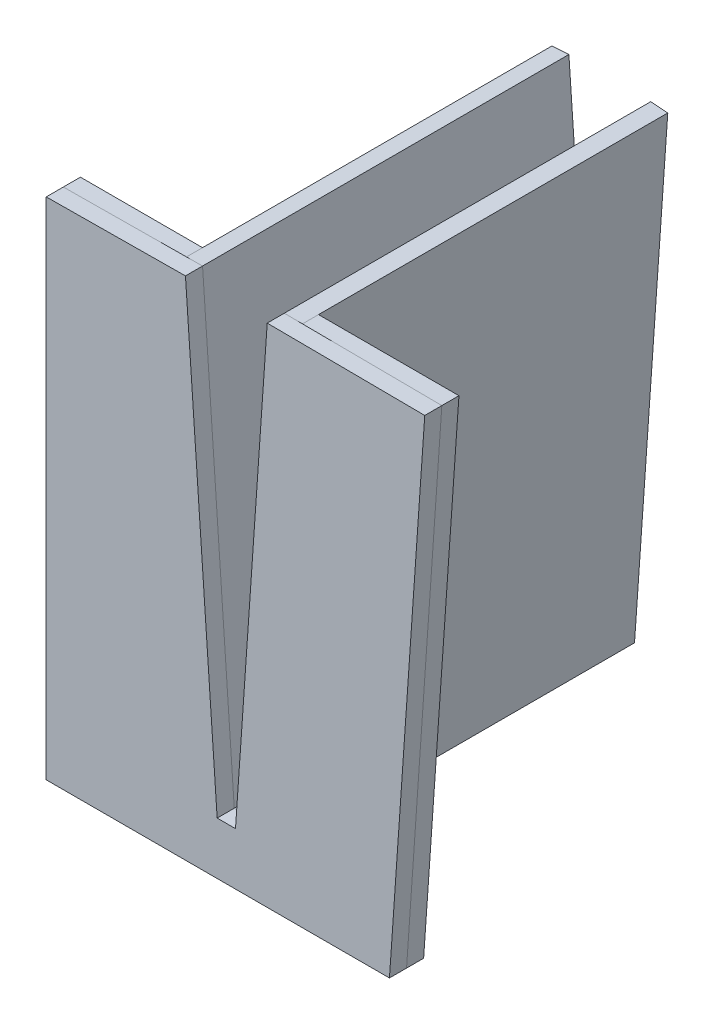
ISO-10303-21;
HEADER;
FILE_DESCRIPTION(('STEP AP214'),'2;1');
FILE_NAME('part.step','',(''),(''),'','','');
FILE_SCHEMA(('AUTOMOTIVE_DESIGN { 1 0 10303 214 1 1 1 1 }'));
ENDSEC;
DATA;
#1=APPLICATION_CONTEXT('core data for automotive mechanical design processes');
#2=APPLICATION_PROTOCOL_DEFINITION('international standard','automotive_design',2000,#1);
#3=PRODUCT_CONTEXT('',#1,'mechanical');
#4=PRODUCT('Part','Part','',(#3));
#5=PRODUCT_RELATED_PRODUCT_CATEGORY('part','',(#4));
#6=PRODUCT_DEFINITION_FORMATION('','',#4);
#7=PRODUCT_DEFINITION_CONTEXT('part definition',#1,'design');
#8=PRODUCT_DEFINITION('design','',#6,#7);
#9=PRODUCT_DEFINITION_SHAPE('','',#8);
#10=(LENGTH_UNIT() NAMED_UNIT(*) SI_UNIT(.MILLI.,.METRE.));
#11=(NAMED_UNIT(*) PLANE_ANGLE_UNIT() SI_UNIT($,.RADIAN.));
#12=(NAMED_UNIT(*) SI_UNIT($,.STERADIAN.) SOLID_ANGLE_UNIT());
#13=UNCERTAINTY_MEASURE_WITH_UNIT(LENGTH_MEASURE(1.E-05),#10,'distance_accuracy_value','');
#14=(GEOMETRIC_REPRESENTATION_CONTEXT(3) GLOBAL_UNCERTAINTY_ASSIGNED_CONTEXT((#13)) GLOBAL_UNIT_ASSIGNED_CONTEXT((#10,
#11,#12)) REPRESENTATION_CONTEXT('',''));
#15=CARTESIAN_POINT('',(0.,0.,0.));
#16=DIRECTION('',(0.,0.,1.));
#17=DIRECTION('',(1.,0.,0.));
#18=AXIS2_PLACEMENT_3D('',#15,#16,#17);
#19=CARTESIAN_POINT('',(-6.69560871661063,77.8758328208899,32.8));
#20=DIRECTION('',(-0.997564050259824,-0.0697564737441254,0.));
#21=DIRECTION('',(0.0697564737441255,-0.997564050259824,0.));
#22=AXIS2_PLACEMENT_3D('',#19,#20,#21);
#23=PLANE('',#22);
#24=DIRECTION('',(-0.0697564737441255,0.997564050259824,0.));
#25=VECTOR('',#24,1.);
#26=CARTESIAN_POINT('',(-6.69560871661063,77.8758328208899,30.));
#27=LINE('',#26,#25);
#28=CARTESIAN_POINT('',(-1.5,3.57516656417799,30.));
#29=VERTEX_POINT('',#28);
#30=CARTESIAN_POINT('',(-6.69560871661063,77.8758328208899,30.));
#31=VERTEX_POINT('',#30);
#32=EDGE_CURVE('E146',#29,#31,#27,.T.);
#33=ORIENTED_EDGE('',*,*,#32,.T.);
#34=DIRECTION('',(0.,0.,-1.));
#35=VECTOR('',#34,1.);
#36=CARTESIAN_POINT('',(-6.69560871661063,77.8758328208899,32.8));
#37=LINE('',#36,#35);
#38=CARTESIAN_POINT('',(-6.69560871661063,77.8758328208899,32.8));
#39=VERTEX_POINT('',#38);
#40=EDGE_CURVE('E12',#39,#31,#37,.T.);
#41=ORIENTED_EDGE('',*,*,#40,.F.);
#42=DIRECTION('',(-0.0697564737441255,0.997564050259824,0.));
#43=VECTOR('',#42,1.);
#44=CARTESIAN_POINT('',(-6.69560871661063,77.8758328208899,32.8));
#45=LINE('',#44,#43);
#46=CARTESIAN_POINT('',(-1.5,3.57516656417799,32.8));
#47=VERTEX_POINT('',#46);
#48=EDGE_CURVE('E160',#47,#39,#45,.T.);
#49=ORIENTED_EDGE('',*,*,#48,.F.);
#50=DIRECTION('',(0.,0.,-1.));
#51=VECTOR('',#50,1.);
#52=CARTESIAN_POINT('',(-1.5,3.57516656417799,32.8));
#53=LINE('',#52,#51);
#54=EDGE_CURVE('E142',#47,#29,#53,.T.);
#55=ORIENTED_EDGE('',*,*,#54,.T.);
#56=EDGE_LOOP('',(#33,#41,#49,#55));
#57=FACE_BOUND('',#56,.T.);
#58=ADVANCED_FACE('F50',(#57),#23,.F.);
#59=CARTESIAN_POINT('',(-6.69560871661063,77.8758328208899,32.8));
#60=DIRECTION('',(0.00858718659502427,-0.999963129433472,0.));
#61=DIRECTION('',(0.999963129433472,0.00858718659502427,0.));
#62=AXIS2_PLACEMENT_3D('',#59,#60,#61);
#63=PLANE('',#62);
#64=DIRECTION('',(-0.999963129433472,-0.00858718659502427,0.));
#65=VECTOR('',#64,1.);
#66=CARTESIAN_POINT('',(-6.69560871661063,77.8758328208899,30.));
#67=LINE('',#66,#65);
#68=CARTESIAN_POINT('',(-29.4956087166106,77.680037747448,30.));
#69=VERTEX_POINT('',#68);
#70=EDGE_CURVE('E149',#31,#69,#67,.T.);
#71=ORIENTED_EDGE('',*,*,#70,.T.);
#72=DIRECTION('',(0.,0.,-1.));
#73=VECTOR('',#72,1.);
#74=CARTESIAN_POINT('',(-29.4956087166106,77.680037747448,32.8));
#75=LINE('',#74,#73);
#76=CARTESIAN_POINT('',(-29.4956087166106,77.680037747448,32.8));
#77=VERTEX_POINT('',#76);
#78=EDGE_CURVE('E58',#77,#69,#75,.T.);
#79=ORIENTED_EDGE('',*,*,#78,.F.);
#80=DIRECTION('',(-0.999963129433472,-0.00858718659502427,0.));
#81=VECTOR('',#80,1.);
#82=CARTESIAN_POINT('',(-6.69560871661063,77.8758328208899,32.8));
#83=LINE('',#82,#81);
#84=EDGE_CURVE('E109',#39,#77,#83,.T.);
#85=ORIENTED_EDGE('',*,*,#84,.F.);
#86=ORIENTED_EDGE('',*,*,#40,.T.);
#87=EDGE_LOOP('',(#71,#79,#85,#86));
#88=FACE_BOUND('',#87,.T.);
#89=ADVANCED_FACE('F195',(#88),#63,.F.);
#90=CARTESIAN_POINT('',(-29.4956087166106,77.680037747448,32.8));
#91=DIRECTION('',(1.,0.,0.));
#92=DIRECTION('',(0.,1.,0.));
#93=AXIS2_PLACEMENT_3D('',#90,#91,#92);
#94=PLANE('',#93);
#95=DIRECTION('',(0.,-1.,0.));
#96=VECTOR('',#95,1.);
#97=CARTESIAN_POINT('',(-29.4956087166106,77.680037747448,30.));
#98=LINE('',#97,#96);
#99=CARTESIAN_POINT('',(-29.4956087166106,-5.,30.));
#100=VERTEX_POINT('',#99);
#101=EDGE_CURVE('E151',#69,#100,#98,.T.);
#102=ORIENTED_EDGE('',*,*,#101,.T.);
#103=DIRECTION('',(0.,0.,-1.));
#104=VECTOR('',#103,1.);
#105=CARTESIAN_POINT('',(-29.4956087166106,-5.,32.8));
#106=LINE('',#105,#104);
#107=CARTESIAN_POINT('',(-29.4956087166106,-5.,32.8));
#108=VERTEX_POINT('',#107);
#109=EDGE_CURVE('E167',#108,#100,#106,.T.);
#110=ORIENTED_EDGE('',*,*,#109,.F.);
#111=DIRECTION('',(0.,-1.,0.));
#112=VECTOR('',#111,1.);
#113=CARTESIAN_POINT('',(-29.4956087166106,77.680037747448,32.8));
#114=LINE('',#113,#112);
#115=EDGE_CURVE('E175',#77,#108,#114,.T.);
#116=ORIENTED_EDGE('',*,*,#115,.F.);
#117=ORIENTED_EDGE('',*,*,#78,.T.);
#118=EDGE_LOOP('',(#102,#110,#116,#117));
#119=FACE_BOUND('',#118,.T.);
#120=ADVANCED_FACE('F173',(#119),#94,.F.);
#121=CARTESIAN_POINT('',(-29.4956087166106,-5.,32.8));
#122=DIRECTION('',(0.,1.,0.));
#123=DIRECTION('',(-1.,0.,0.));
#124=AXIS2_PLACEMENT_3D('',#121,#122,#123);
#125=PLANE('',#124);
#126=DIRECTION('',(1.,0.,0.));
#127=VECTOR('',#126,1.);
#128=CARTESIAN_POINT('',(-29.4956087166106,-5.,30.));
#129=LINE('',#128,#127);
#130=CARTESIAN_POINT('',(26.7140572655625,-5.,30.));
#131=VERTEX_POINT('',#130);
#132=EDGE_CURVE('E153',#100,#131,#129,.T.);
#133=ORIENTED_EDGE('',*,*,#132,.T.);
#134=DIRECTION('',(0.,0.,-1.));
#135=VECTOR('',#134,1.);
#136=CARTESIAN_POINT('',(26.7140572655625,-5.,32.8));
#137=LINE('',#136,#135);
#138=CARTESIAN_POINT('',(26.7140572655625,-5.,32.8));
#139=VERTEX_POINT('',#138);
#140=EDGE_CURVE('E164',#139,#131,#137,.T.);
#141=ORIENTED_EDGE('',*,*,#140,.F.);
#142=DIRECTION('',(1.,0.,0.));
#143=VECTOR('',#142,1.);
#144=CARTESIAN_POINT('',(-29.4956087166106,-5.,32.8));
#145=LINE('',#144,#143);
#146=EDGE_CURVE('E187',#108,#139,#145,.T.);
#147=ORIENTED_EDGE('',*,*,#146,.F.);
#148=ORIENTED_EDGE('',*,*,#109,.T.);
#149=EDGE_LOOP('',(#133,#141,#147,#148));
#150=FACE_BOUND('',#149,.T.);
#151=ADVANCED_FACE('F183',(#150),#125,.F.);
#152=CARTESIAN_POINT('',(26.7140572655625,-5.,32.8));
#153=DIRECTION('',(-0.997564050259824,0.0697564737441254,0.));
#154=DIRECTION('',(-0.0697564737441255,-0.997564050259824,0.));
#155=AXIS2_PLACEMENT_3D('',#152,#153,#154);
#156=PLANE('',#155);
#157=DIRECTION('',(0.0697564737441254,0.997564050259824,0.));
#158=VECTOR('',#157,1.);
#159=CARTESIAN_POINT('',(26.7140572655625,-5.,30.));
#160=LINE('',#159,#158);
#161=CARTESIAN_POINT('',(32.4956087166106,77.680037747448,30.));
#162=VERTEX_POINT('',#161);
#163=EDGE_CURVE('E155',#131,#162,#160,.T.);
#164=ORIENTED_EDGE('',*,*,#163,.T.);
#165=DIRECTION('',(0.,0.,-1.));
#166=VECTOR('',#165,1.);
#167=CARTESIAN_POINT('',(32.4956087166106,77.680037747448,32.8));
#168=LINE('',#167,#166);
#169=CARTESIAN_POINT('',(32.4956087166106,77.680037747448,32.8));
#170=VERTEX_POINT('',#169);
#171=EDGE_CURVE('E137',#170,#162,#168,.T.);
#172=ORIENTED_EDGE('',*,*,#171,.F.);
#173=DIRECTION('',(0.0697564737441254,0.997564050259824,0.));
#174=VECTOR('',#173,1.);
#175=CARTESIAN_POINT('',(26.7140572655625,-5.,32.8));
#176=LINE('',#175,#174);
#177=EDGE_CURVE('E128',#139,#170,#176,.T.);
#178=ORIENTED_EDGE('',*,*,#177,.F.);
#179=ORIENTED_EDGE('',*,*,#140,.T.);
#180=EDGE_LOOP('',(#164,#172,#178,#179));
#181=FACE_BOUND('',#180,.T.);
#182=ADVANCED_FACE('F186',(#181),#156,.F.);
#183=CARTESIAN_POINT('',(32.4956087166106,77.680037747448,32.8));
#184=DIRECTION('',(-0.00758873781182769,-0.999971205114639,0.));
#185=DIRECTION('',(0.999971205114639,-0.00758873781182769,0.));
#186=AXIS2_PLACEMENT_3D('',#183,#184,#185);
#187=PLANE('',#186);
#188=DIRECTION('',(-0.999971205114639,0.00758873781182769,0.));
#189=VECTOR('',#188,1.);
#190=CARTESIAN_POINT('',(32.4956087166106,77.680037747448,30.));
#191=LINE('',#190,#189);
#192=CARTESIAN_POINT('',(6.69560871661063,77.8758328208899,30.));
#193=VERTEX_POINT('',#192);
#194=EDGE_CURVE('E136',#162,#193,#191,.T.);
#195=ORIENTED_EDGE('',*,*,#194,.T.);
#196=DIRECTION('',(0.,0.,-1.));
#197=VECTOR('',#196,1.);
#198=CARTESIAN_POINT('',(6.69560871661063,77.8758328208899,32.8));
#199=LINE('',#198,#197);
#200=CARTESIAN_POINT('',(6.69560871661063,77.8758328208899,32.8));
#201=VERTEX_POINT('',#200);
#202=EDGE_CURVE('E133',#201,#193,#199,.T.);
#203=ORIENTED_EDGE('',*,*,#202,.F.);
#204=DIRECTION('',(-0.999971205114639,0.00758873781182769,0.));
#205=VECTOR('',#204,1.);
#206=CARTESIAN_POINT('',(32.4956087166106,77.680037747448,32.8));
#207=LINE('',#206,#205);
#208=EDGE_CURVE('E122',#170,#201,#207,.T.);
#209=ORIENTED_EDGE('',*,*,#208,.F.);
#210=ORIENTED_EDGE('',*,*,#171,.T.);
#211=EDGE_LOOP('',(#195,#203,#209,#210));
#212=FACE_BOUND('',#211,.T.);
#213=ADVANCED_FACE('F134',(#212),#187,.F.);
#214=CARTESIAN_POINT('',(6.69560871661063,77.8758328208899,32.8));
#215=DIRECTION('',(0.997564050259824,-0.0697564737441254,0.));
#216=DIRECTION('',(0.0697564737441255,0.997564050259824,0.));
#217=AXIS2_PLACEMENT_3D('',#214,#215,#216);
#218=PLANE('',#217);
#219=DIRECTION('',(-0.0697564737441255,-0.997564050259824,0.));
#220=VECTOR('',#219,1.);
#221=CARTESIAN_POINT('',(6.69560871661063,77.8758328208899,30.));
#222=LINE('',#221,#220);
#223=CARTESIAN_POINT('',(1.5,3.57516656417799,30.));
#224=VERTEX_POINT('',#223);
#225=EDGE_CURVE('E95',#193,#224,#222,.T.);
#226=ORIENTED_EDGE('',*,*,#225,.T.);
#227=DIRECTION('',(0.,0.,-1.));
#228=VECTOR('',#227,1.);
#229=CARTESIAN_POINT('',(1.5,3.57516656417799,32.8));
#230=LINE('',#229,#228);
#231=CARTESIAN_POINT('',(1.5,3.57516656417799,32.8));
#232=VERTEX_POINT('',#231);
#233=EDGE_CURVE('E138',#232,#224,#230,.T.);
#234=ORIENTED_EDGE('',*,*,#233,.F.);
#235=DIRECTION('',(-0.0697564737441255,-0.997564050259824,0.));
#236=VECTOR('',#235,1.);
#237=CARTESIAN_POINT('',(6.69560871661063,77.8758328208899,32.8));
#238=LINE('',#237,#236);
#239=EDGE_CURVE('E126',#201,#232,#238,.T.);
#240=ORIENTED_EDGE('',*,*,#239,.F.);
#241=ORIENTED_EDGE('',*,*,#202,.T.);
#242=EDGE_LOOP('',(#226,#234,#240,#241));
#243=FACE_BOUND('',#242,.T.);
#244=ADVANCED_FACE('F140',(#243),#218,.F.);
#245=CARTESIAN_POINT('',(-1.5,3.57516656417799,32.8));
#246=DIRECTION('',(0.,-1.,0.));
#247=DIRECTION('',(1.,0.,0.));
#248=AXIS2_PLACEMENT_3D('',#245,#246,#247);
#249=PLANE('',#248);
#250=DIRECTION('',(-1.,0.,0.));
#251=VECTOR('',#250,1.);
#252=CARTESIAN_POINT('',(-1.5,3.57516656417799,30.));
#253=LINE('',#252,#251);
#254=EDGE_CURVE('E101',#224,#29,#253,.T.);
#255=ORIENTED_EDGE('',*,*,#254,.T.);
#256=ORIENTED_EDGE('',*,*,#54,.F.);
#257=DIRECTION('',(-1.,0.,0.));
#258=VECTOR('',#257,1.);
#259=CARTESIAN_POINT('',(-1.5,3.57516656417799,32.8));
#260=LINE('',#259,#258);
#261=EDGE_CURVE('E66',#232,#47,#260,.T.);
#262=ORIENTED_EDGE('',*,*,#261,.F.);
#263=ORIENTED_EDGE('',*,*,#233,.T.);
#264=EDGE_LOOP('',(#255,#256,#262,#263));
#265=FACE_BOUND('',#264,.T.);
#266=ADVANCED_FACE('F211',(#265),#249,.F.);
#267=CARTESIAN_POINT('',(0.,0.,32.8));
#268=DIRECTION('',(0.,0.,-1.));
#269=DIRECTION('',(-1.,0.,0.));
#270=AXIS2_PLACEMENT_3D('',#267,#268,#269);
#271=PLANE('',#270);
#272=ORIENTED_EDGE('',*,*,#48,.T.);
#273=ORIENTED_EDGE('',*,*,#84,.T.);
#274=ORIENTED_EDGE('',*,*,#115,.T.);
#275=ORIENTED_EDGE('',*,*,#146,.T.);
#276=ORIENTED_EDGE('',*,*,#177,.T.);
#277=ORIENTED_EDGE('',*,*,#208,.T.);
#278=ORIENTED_EDGE('',*,*,#239,.T.);
#279=ORIENTED_EDGE('',*,*,#261,.T.);
#280=EDGE_LOOP('',(#272,#273,#274,#275,#276,#277,#278,#279));
#281=FACE_BOUND('',#280,.T.);
#282=ADVANCED_FACE('F124',(#281),#271,.F.);
#283=CARTESIAN_POINT('',(0.,0.,30.));
#284=DIRECTION('',(0.,0.,-1.));
#285=DIRECTION('',(-1.,0.,0.));
#286=AXIS2_PLACEMENT_3D('',#283,#284,#285);
#287=PLANE('',#286);
#288=ORIENTED_EDGE('',*,*,#32,.F.);
#289=ORIENTED_EDGE('',*,*,#254,.F.);
#290=ORIENTED_EDGE('',*,*,#225,.F.);
#291=ORIENTED_EDGE('',*,*,#194,.F.);
#292=ORIENTED_EDGE('',*,*,#163,.F.);
#293=ORIENTED_EDGE('',*,*,#132,.F.);
#294=ORIENTED_EDGE('',*,*,#101,.F.);
#295=ORIENTED_EDGE('',*,*,#70,.F.);
#296=EDGE_LOOP('',(#288,#289,#290,#291,#292,#293,#294,#295));
#297=FACE_BOUND('',#296,.T.);
#298=ADVANCED_FACE('F179',(#297),#287,.T.);
#299=CLOSED_SHELL('',(#58,#89,#120,#151,#182,#213,#244,#266,#282,#298));
#300=MANIFOLD_SOLID_BREP('B2',#299);
#301=CARTESIAN_POINT('',(-29.4956087166106,-5.,27.2));
#302=DIRECTION('',(0.,-1.,0.));
#303=DIRECTION('',(1.,0.,0.));
#304=AXIS2_PLACEMENT_3D('',#301,#302,#303);
#305=PLANE('',#304);
#306=DIRECTION('',(1.,0.,0.));
#307=VECTOR('',#306,1.);
#308=CARTESIAN_POINT('',(-29.4956087166106,-5.,30.));
#309=LINE('',#308,#307);
#310=CARTESIAN_POINT('',(-29.4956087166106,-5.,30.));
#311=VERTEX_POINT('',#310);
#312=CARTESIAN_POINT('',(26.7140572655625,-5.,30.));
#313=VERTEX_POINT('',#312);
#314=EDGE_CURVE('E409',#311,#313,#309,.T.);
#315=ORIENTED_EDGE('',*,*,#314,.F.);
#316=DIRECTION('',(0.,0.,1.));
#317=VECTOR('',#316,1.);
#318=CARTESIAN_POINT('',(-29.4956087166106,-5.,27.2));
#319=LINE('',#318,#317);
#320=CARTESIAN_POINT('',(-29.4956087166106,-5.,27.2));
#321=VERTEX_POINT('',#320);
#322=EDGE_CURVE('E48',#321,#311,#319,.T.);
#323=ORIENTED_EDGE('',*,*,#322,.F.);
#324=DIRECTION('',(1.,0.,0.));
#325=VECTOR('',#324,1.);
#326=CARTESIAN_POINT('',(-29.4956087166106,-5.,27.2));
#327=LINE('',#326,#325);
#328=CARTESIAN_POINT('',(26.7140572655625,-5.,27.2));
#329=VERTEX_POINT('',#328);
#330=EDGE_CURVE('E441',#321,#329,#327,.T.);
#331=ORIENTED_EDGE('',*,*,#330,.T.);
#332=DIRECTION('',(0.,0.,1.));
#333=VECTOR('',#332,1.);
#334=CARTESIAN_POINT('',(26.7140572655625,-5.,27.2));
#335=LINE('',#334,#333);
#336=EDGE_CURVE('E291',#329,#313,#335,.T.);
#337=ORIENTED_EDGE('',*,*,#336,.T.);
#338=EDGE_LOOP('',(#315,#323,#331,#337));
#339=FACE_BOUND('',#338,.T.);
#340=ADVANCED_FACE('F288',(#339),#305,.T.);
#341=CARTESIAN_POINT('',(-29.4956087166106,77.680037747448,27.2));
#342=DIRECTION('',(-1.,0.,0.));
#343=DIRECTION('',(0.,-1.,0.));
#344=AXIS2_PLACEMENT_3D('',#341,#342,#343);
#345=PLANE('',#344);
#346=DIRECTION('',(0.,-1.,0.));
#347=VECTOR('',#346,1.);
#348=CARTESIAN_POINT('',(-29.4956087166106,77.680037747448,30.));
#349=LINE('',#348,#347);
#350=CARTESIAN_POINT('',(-29.4956087166106,77.680037747448,30.));
#351=VERTEX_POINT('',#350);
#352=EDGE_CURVE('E439',#351,#311,#349,.T.);
#353=ORIENTED_EDGE('',*,*,#352,.F.);
#354=DIRECTION('',(0.,0.,1.));
#355=VECTOR('',#354,1.);
#356=CARTESIAN_POINT('',(-29.4956087166106,77.680037747448,27.2));
#357=LINE('',#356,#355);
#358=CARTESIAN_POINT('',(-29.4956087166106,77.680037747448,27.2));
#359=VERTEX_POINT('',#358);
#360=EDGE_CURVE('E297',#359,#351,#357,.T.);
#361=ORIENTED_EDGE('',*,*,#360,.F.);
#362=DIRECTION('',(0.,-1.,0.));
#363=VECTOR('',#362,1.);
#364=CARTESIAN_POINT('',(-29.4956087166106,77.680037747448,27.2));
#365=LINE('',#364,#363);
#366=EDGE_CURVE('E399',#359,#321,#365,.T.);
#367=ORIENTED_EDGE('',*,*,#366,.T.);
#368=ORIENTED_EDGE('',*,*,#322,.T.);
#369=EDGE_LOOP('',(#353,#361,#367,#368));
#370=FACE_BOUND('',#369,.T.);
#371=ADVANCED_FACE('F461',(#370),#345,.T.);
#372=CARTESIAN_POINT('',(-9.49560871661063,77.680037747448,27.2));
#373=DIRECTION('',(0.,1.,0.));
#374=DIRECTION('',(0.,0.,1.));
#375=AXIS2_PLACEMENT_3D('',#372,#373,#374);
#376=PLANE('',#375);
#377=DIRECTION('',(-1.,0.,0.));
#378=VECTOR('',#377,1.);
#379=CARTESIAN_POINT('',(-9.49560871661063,77.680037747448,30.));
#380=LINE('',#379,#378);
#381=CARTESIAN_POINT('',(-9.49560871661063,77.680037747448,30.));
#382=VERTEX_POINT('',#381);
#383=EDGE_CURVE('E386',#382,#351,#380,.T.);
#384=ORIENTED_EDGE('',*,*,#383,.F.);
#385=DIRECTION('',(0.,0.,1.));
#386=VECTOR('',#385,1.);
#387=CARTESIAN_POINT('',(-9.49560871661063,77.680037747448,27.2));
#388=LINE('',#387,#386);
#389=CARTESIAN_POINT('',(-9.49560871661063,77.680037747448,27.2));
#390=VERTEX_POINT('',#389);
#391=EDGE_CURVE('E381',#390,#382,#388,.T.);
#392=ORIENTED_EDGE('',*,*,#391,.F.);
#393=DIRECTION('',(-1.,0.,0.));
#394=VECTOR('',#393,1.);
#395=CARTESIAN_POINT('',(-9.49560871661063,77.680037747448,27.2));
#396=LINE('',#395,#394);
#397=EDGE_CURVE('E384',#390,#359,#396,.T.);
#398=ORIENTED_EDGE('',*,*,#397,.T.);
#399=ORIENTED_EDGE('',*,*,#360,.T.);
#400=EDGE_LOOP('',(#384,#392,#398,#399));
#401=FACE_BOUND('',#400,.T.);
#402=ADVANCED_FACE('F383',(#401),#376,.T.);
#403=CARTESIAN_POINT('',(-4.05,-0.19579507344183,27.2));
#404=DIRECTION('',(0.997564050259824,0.0697564737441255,0.));
#405=DIRECTION('',(-0.0697564737441255,0.997564050259824,0.));
#406=AXIS2_PLACEMENT_3D('',#403,#404,#405);
#407=PLANE('',#406);
#408=DIRECTION('',(-0.0697564737441255,0.997564050259824,0.));
#409=VECTOR('',#408,1.);
#410=CARTESIAN_POINT('',(-4.05,-0.19579507344183,30.));
#411=LINE('',#410,#409);
#412=CARTESIAN_POINT('',(-4.05,-0.19579507344183,30.));
#413=VERTEX_POINT('',#412);
#414=EDGE_CURVE('E436',#413,#382,#411,.T.);
#415=ORIENTED_EDGE('',*,*,#414,.F.);
#416=DIRECTION('',(0.,0.,1.));
#417=VECTOR('',#416,1.);
#418=CARTESIAN_POINT('',(-4.05,-0.19579507344183,27.2));
#419=LINE('',#418,#417);
#420=CARTESIAN_POINT('',(-4.05,-0.19579507344183,27.2));
#421=VERTEX_POINT('',#420);
#422=EDGE_CURVE('E391',#421,#413,#419,.T.);
#423=ORIENTED_EDGE('',*,*,#422,.F.);
#424=DIRECTION('',(-0.0697564737441255,0.997564050259824,0.));
#425=VECTOR('',#424,1.);
#426=CARTESIAN_POINT('',(-4.05,-0.19579507344183,27.2));
#427=LINE('',#426,#425);
#428=EDGE_CURVE('E397',#421,#390,#427,.T.);
#429=ORIENTED_EDGE('',*,*,#428,.T.);
#430=ORIENTED_EDGE('',*,*,#391,.T.);
#431=EDGE_LOOP('',(#415,#423,#429,#430));
#432=FACE_BOUND('',#431,.T.);
#433=ADVANCED_FACE('F401',(#432),#407,.T.);
#434=CARTESIAN_POINT('',(-1.25,0.,27.2));
#435=DIRECTION('',(-0.0697564737441257,0.997564050259824,0.));
#436=DIRECTION('',(-0.997564050259824,-0.0697564737441257,0.));
#437=AXIS2_PLACEMENT_3D('',#434,#435,#436);
#438=PLANE('',#437);
#439=DIRECTION('',(-0.997564050259824,-0.0697564737441257,0.));
#440=VECTOR('',#439,1.);
#441=CARTESIAN_POINT('',(-1.25,0.,30.));
#442=LINE('',#441,#440);
#443=CARTESIAN_POINT('',(-1.25,0.,30.));
#444=VERTEX_POINT('',#443);
#445=EDGE_CURVE('E433',#444,#413,#442,.T.);
#446=ORIENTED_EDGE('',*,*,#445,.F.);
#447=DIRECTION('',(0.,0.,1.));
#448=VECTOR('',#447,1.);
#449=CARTESIAN_POINT('',(-1.25,0.,27.2));
#450=LINE('',#449,#448);
#451=CARTESIAN_POINT('',(-1.25,0.,27.2));
#452=VERTEX_POINT('',#451);
#453=EDGE_CURVE('E445',#452,#444,#450,.T.);
#454=ORIENTED_EDGE('',*,*,#453,.F.);
#455=DIRECTION('',(-0.997564050259824,-0.0697564737441257,0.));
#456=VECTOR('',#455,1.);
#457=CARTESIAN_POINT('',(-1.25,0.,27.2));
#458=LINE('',#457,#456);
#459=EDGE_CURVE('E402',#452,#421,#458,.T.);
#460=ORIENTED_EDGE('',*,*,#459,.T.);
#461=ORIENTED_EDGE('',*,*,#422,.T.);
#462=EDGE_LOOP('',(#446,#454,#460,#461));
#463=FACE_BOUND('',#462,.T.);
#464=ADVANCED_FACE('F474',(#463),#438,.T.);
#465=CARTESIAN_POINT('',(-1.5,3.57516656417799,27.2));
#466=DIRECTION('',(-0.997564050259824,-0.0697564737441251,0.));
#467=DIRECTION('',(0.0697564737441252,-0.997564050259824,0.));
#468=AXIS2_PLACEMENT_3D('',#465,#466,#467);
#469=PLANE('',#468);
#470=DIRECTION('',(0.0697564737441251,-0.997564050259824,0.));
#471=VECTOR('',#470,1.);
#472=CARTESIAN_POINT('',(-1.5,3.57516656417799,30.));
#473=LINE('',#472,#471);
#474=CARTESIAN_POINT('',(-1.5,3.57516656417799,30.));
#475=VERTEX_POINT('',#474);
#476=EDGE_CURVE('E430',#475,#444,#473,.T.);
#477=ORIENTED_EDGE('',*,*,#476,.F.);
#478=DIRECTION('',(0.,0.,1.));
#479=VECTOR('',#478,1.);
#480=CARTESIAN_POINT('',(-1.5,3.57516656417799,27.2));
#481=LINE('',#480,#479);
#482=CARTESIAN_POINT('',(-1.5,3.57516656417799,27.2));
#483=VERTEX_POINT('',#482);
#484=EDGE_CURVE('E447',#483,#475,#481,.T.);
#485=ORIENTED_EDGE('',*,*,#484,.F.);
#486=DIRECTION('',(0.0697564737441251,-0.997564050259824,0.));
#487=VECTOR('',#486,1.);
#488=CARTESIAN_POINT('',(-1.5,3.57516656417799,27.2));
#489=LINE('',#488,#487);
#490=EDGE_CURVE('E404',#483,#452,#489,.T.);
#491=ORIENTED_EDGE('',*,*,#490,.T.);
#492=ORIENTED_EDGE('',*,*,#453,.T.);
#493=EDGE_LOOP('',(#477,#485,#491,#492));
#494=FACE_BOUND('',#493,.T.);
#495=ADVANCED_FACE('F477',(#494),#469,.T.);
#496=CARTESIAN_POINT('',(-1.5,3.57516656417799,27.2));
#497=DIRECTION('',(0.,1.,0.));
#498=DIRECTION('',(-1.,0.,0.));
#499=AXIS2_PLACEMENT_3D('',#496,#497,#498);
#500=PLANE('',#499);
#501=DIRECTION('',(-1.,0.,0.));
#502=VECTOR('',#501,1.);
#503=CARTESIAN_POINT('',(-1.5,3.57516656417799,30.));
#504=LINE('',#503,#502);
#505=CARTESIAN_POINT('',(1.5,3.57516656417799,30.));
#506=VERTEX_POINT('',#505);
#507=EDGE_CURVE('E427',#506,#475,#504,.T.);
#508=ORIENTED_EDGE('',*,*,#507,.F.);
#509=DIRECTION('',(0.,0.,1.));
#510=VECTOR('',#509,1.);
#511=CARTESIAN_POINT('',(1.5,3.57516656417799,27.2));
#512=LINE('',#511,#510);
#513=CARTESIAN_POINT('',(1.5,3.57516656417799,27.2));
#514=VERTEX_POINT('',#513);
#515=EDGE_CURVE('E449',#514,#506,#512,.T.);
#516=ORIENTED_EDGE('',*,*,#515,.F.);
#517=DIRECTION('',(-1.,0.,0.));
#518=VECTOR('',#517,1.);
#519=CARTESIAN_POINT('',(-1.5,3.57516656417799,27.2));
#520=LINE('',#519,#518);
#521=EDGE_CURVE('E603',#514,#483,#520,.T.);
#522=ORIENTED_EDGE('',*,*,#521,.T.);
#523=ORIENTED_EDGE('',*,*,#484,.T.);
#524=EDGE_LOOP('',(#508,#516,#522,#523));
#525=FACE_BOUND('',#524,.T.);
#526=ADVANCED_FACE('F481',(#525),#500,.T.);
#527=CARTESIAN_POINT('',(1.25,0.,27.2));
#528=DIRECTION('',(0.997564050259824,-0.0697564737441252,0.));
#529=DIRECTION('',(0.0697564737441252,0.997564050259824,0.));
#530=AXIS2_PLACEMENT_3D('',#527,#528,#529);
#531=PLANE('',#530);
#532=DIRECTION('',(0.0697564737441252,0.997564050259824,0.));
#533=VECTOR('',#532,1.);
#534=CARTESIAN_POINT('',(1.25,0.,30.));
#535=LINE('',#534,#533);
#536=CARTESIAN_POINT('',(1.25,0.,30.));
#537=VERTEX_POINT('',#536);
#538=EDGE_CURVE('E424',#537,#506,#535,.T.);
#539=ORIENTED_EDGE('',*,*,#538,.F.);
#540=DIRECTION('',(0.,0.,1.));
#541=VECTOR('',#540,1.);
#542=CARTESIAN_POINT('',(1.25,0.,27.2));
#543=LINE('',#542,#541);
#544=CARTESIAN_POINT('',(1.25,0.,27.2));
#545=VERTEX_POINT('',#544);
#546=EDGE_CURVE('E451',#545,#537,#543,.T.);
#547=ORIENTED_EDGE('',*,*,#546,.F.);
#548=DIRECTION('',(0.0697564737441252,0.997564050259824,0.));
#549=VECTOR('',#548,1.);
#550=CARTESIAN_POINT('',(1.25,0.,27.2));
#551=LINE('',#550,#549);
#552=EDGE_CURVE('E607',#545,#514,#551,.T.);
#553=ORIENTED_EDGE('',*,*,#552,.T.);
#554=ORIENTED_EDGE('',*,*,#515,.T.);
#555=EDGE_LOOP('',(#539,#547,#553,#554));
#556=FACE_BOUND('',#555,.T.);
#557=ADVANCED_FACE('F485',(#556),#531,.T.);
#558=CARTESIAN_POINT('',(4.05,-0.19579507344183,27.2));
#559=DIRECTION('',(0.0697564737441253,0.997564050259824,0.));
#560=DIRECTION('',(-0.997564050259824,0.0697564737441253,0.));
#561=AXIS2_PLACEMENT_3D('',#558,#559,#560);
#562=PLANE('',#561);
#563=DIRECTION('',(-0.997564050259824,0.0697564737441253,0.));
#564=VECTOR('',#563,1.);
#565=CARTESIAN_POINT('',(4.05,-0.19579507344183,30.));
#566=LINE('',#565,#564);
#567=CARTESIAN_POINT('',(4.05,-0.19579507344183,30.));
#568=VERTEX_POINT('',#567);
#569=EDGE_CURVE('E421',#568,#537,#566,.T.);
#570=ORIENTED_EDGE('',*,*,#569,.F.);
#571=DIRECTION('',(0.,0.,1.));
#572=VECTOR('',#571,1.);
#573=CARTESIAN_POINT('',(4.05,-0.19579507344183,27.2));
#574=LINE('',#573,#572);
#575=CARTESIAN_POINT('',(4.05,-0.19579507344183,27.2));
#576=VERTEX_POINT('',#575);
#577=EDGE_CURVE('E453',#576,#568,#574,.T.);
#578=ORIENTED_EDGE('',*,*,#577,.F.);
#579=DIRECTION('',(-0.997564050259824,0.0697564737441253,0.));
#580=VECTOR('',#579,1.);
#581=CARTESIAN_POINT('',(4.05,-0.19579507344183,27.2));
#582=LINE('',#581,#580);
#583=EDGE_CURVE('E596',#576,#545,#582,.T.);
#584=ORIENTED_EDGE('',*,*,#583,.T.);
#585=ORIENTED_EDGE('',*,*,#546,.T.);
#586=EDGE_LOOP('',(#570,#578,#584,#585));
#587=FACE_BOUND('',#586,.T.);
#588=ADVANCED_FACE('F489',(#587),#562,.T.);
#589=CARTESIAN_POINT('',(9.49560871661063,77.680037747448,27.2));
#590=DIRECTION('',(-0.997564050259824,0.0697564737441254,0.));
#591=DIRECTION('',(-0.0697564737441255,-0.997564050259824,0.));
#592=AXIS2_PLACEMENT_3D('',#589,#590,#591);
#593=PLANE('',#592);
#594=DIRECTION('',(-0.0697564737441254,-0.997564050259824,0.));
#595=VECTOR('',#594,1.);
#596=CARTESIAN_POINT('',(9.49560871661063,77.680037747448,30.));
#597=LINE('',#596,#595);
#598=CARTESIAN_POINT('',(9.49560871661063,77.680037747448,30.));
#599=VERTEX_POINT('',#598);
#600=EDGE_CURVE('E418',#599,#568,#597,.T.);
#601=ORIENTED_EDGE('',*,*,#600,.F.);
#602=DIRECTION('',(0.,0.,1.));
#603=VECTOR('',#602,1.);
#604=CARTESIAN_POINT('',(9.49560871661063,77.680037747448,27.2));
#605=LINE('',#604,#603);
#606=CARTESIAN_POINT('',(9.49560871661063,77.680037747448,27.2));
#607=VERTEX_POINT('',#606);
#608=EDGE_CURVE('E455',#607,#599,#605,.T.);
#609=ORIENTED_EDGE('',*,*,#608,.F.);
#610=DIRECTION('',(-0.0697564737441254,-0.997564050259824,0.));
#611=VECTOR('',#610,1.);
#612=CARTESIAN_POINT('',(9.49560871661063,77.680037747448,27.2));
#613=LINE('',#612,#611);
#614=EDGE_CURVE('E592',#607,#576,#613,.T.);
#615=ORIENTED_EDGE('',*,*,#614,.T.);
#616=ORIENTED_EDGE('',*,*,#577,.T.);
#617=EDGE_LOOP('',(#601,#609,#615,#616));
#618=FACE_BOUND('',#617,.T.);
#619=ADVANCED_FACE('F493',(#618),#593,.T.);
#620=CARTESIAN_POINT('',(32.4956087166106,77.680037747448,27.2));
#621=DIRECTION('',(0.,1.,0.));
#622=DIRECTION('',(0.,0.,1.));
#623=AXIS2_PLACEMENT_3D('',#620,#621,#622);
#624=PLANE('',#623);
#625=DIRECTION('',(-1.,0.,0.));
#626=VECTOR('',#625,1.);
#627=CARTESIAN_POINT('',(32.4956087166106,77.680037747448,30.));
#628=LINE('',#627,#626);
#629=CARTESIAN_POINT('',(32.4956087166106,77.680037747448,30.));
#630=VERTEX_POINT('',#629);
#631=EDGE_CURVE('E415',#630,#599,#628,.T.);
#632=ORIENTED_EDGE('',*,*,#631,.F.);
#633=DIRECTION('',(0.,0.,1.));
#634=VECTOR('',#633,1.);
#635=CARTESIAN_POINT('',(32.4956087166106,77.680037747448,27.2));
#636=LINE('',#635,#634);
#637=CARTESIAN_POINT('',(32.4956087166106,77.680037747448,27.2));
#638=VERTEX_POINT('',#637);
#639=EDGE_CURVE('E456',#638,#630,#636,.T.);
#640=ORIENTED_EDGE('',*,*,#639,.F.);
#641=DIRECTION('',(-1.,0.,0.));
#642=VECTOR('',#641,1.);
#643=CARTESIAN_POINT('',(32.4956087166106,77.680037747448,27.2));
#644=LINE('',#643,#642);
#645=EDGE_CURVE('E613',#638,#607,#644,.T.);
#646=ORIENTED_EDGE('',*,*,#645,.T.);
#647=ORIENTED_EDGE('',*,*,#608,.T.);
#648=EDGE_LOOP('',(#632,#640,#646,#647));
#649=FACE_BOUND('',#648,.T.);
#650=ADVANCED_FACE('F497',(#649),#624,.T.);
#651=CARTESIAN_POINT('',(32.4956087166106,77.680037747448,27.2));
#652=DIRECTION('',(0.997564050259824,-0.0697564737441254,0.));
#653=DIRECTION('',(0.0697564737441255,0.997564050259824,0.));
#654=AXIS2_PLACEMENT_3D('',#651,#652,#653);
#655=PLANE('',#654);
#656=DIRECTION('',(0.0697564737441254,0.997564050259824,0.));
#657=VECTOR('',#656,1.);
#658=CARTESIAN_POINT('',(32.4956087166106,77.680037747448,30.));
#659=LINE('',#658,#657);
#660=EDGE_CURVE('E412',#313,#630,#659,.T.);
#661=ORIENTED_EDGE('',*,*,#660,.F.);
#662=ORIENTED_EDGE('',*,*,#336,.F.);
#663=DIRECTION('',(0.0697564737441254,0.997564050259824,0.));
#664=VECTOR('',#663,1.);
#665=CARTESIAN_POINT('',(32.4956087166106,77.680037747448,27.2));
#666=LINE('',#665,#664);
#667=EDGE_CURVE('E615',#329,#638,#666,.T.);
#668=ORIENTED_EDGE('',*,*,#667,.T.);
#669=ORIENTED_EDGE('',*,*,#639,.T.);
#670=EDGE_LOOP('',(#661,#662,#668,#669));
#671=FACE_BOUND('',#670,.T.);
#672=ADVANCED_FACE('F458',(#671),#655,.T.);
#673=CARTESIAN_POINT('',(0.,0.,27.2));
#674=DIRECTION('',(0.,0.,-1.));
#675=DIRECTION('',(-1.,0.,0.));
#676=AXIS2_PLACEMENT_3D('',#673,#674,#675);
#677=PLANE('',#676);
#678=ORIENTED_EDGE('',*,*,#330,.F.);
#679=ORIENTED_EDGE('',*,*,#366,.F.);
#680=ORIENTED_EDGE('',*,*,#397,.F.);
#681=ORIENTED_EDGE('',*,*,#428,.F.);
#682=ORIENTED_EDGE('',*,*,#459,.F.);
#683=ORIENTED_EDGE('',*,*,#490,.F.);
#684=ORIENTED_EDGE('',*,*,#521,.F.);
#685=ORIENTED_EDGE('',*,*,#552,.F.);
#686=ORIENTED_EDGE('',*,*,#583,.F.);
#687=ORIENTED_EDGE('',*,*,#614,.F.);
#688=ORIENTED_EDGE('',*,*,#645,.F.);
#689=ORIENTED_EDGE('',*,*,#667,.F.);
#690=EDGE_LOOP('',(#678,#679,#680,#681,#682,#683,#684,#685,#686,#687,#688,#689));
#691=FACE_BOUND('',#690,.T.);
#692=ADVANCED_FACE('F395',(#691),#677,.T.);
#693=CARTESIAN_POINT('',(0.,0.,30.));
#694=DIRECTION('',(0.,0.,-1.));
#695=DIRECTION('',(-1.,0.,0.));
#696=AXIS2_PLACEMENT_3D('',#693,#694,#695);
#697=PLANE('',#696);
#698=ORIENTED_EDGE('',*,*,#314,.T.);
#699=ORIENTED_EDGE('',*,*,#660,.T.);
#700=ORIENTED_EDGE('',*,*,#631,.T.);
#701=ORIENTED_EDGE('',*,*,#600,.T.);
#702=ORIENTED_EDGE('',*,*,#569,.T.);
#703=ORIENTED_EDGE('',*,*,#538,.T.);
#704=ORIENTED_EDGE('',*,*,#507,.T.);
#705=ORIENTED_EDGE('',*,*,#476,.T.);
#706=ORIENTED_EDGE('',*,*,#445,.T.);
#707=ORIENTED_EDGE('',*,*,#414,.T.);
#708=ORIENTED_EDGE('',*,*,#383,.T.);
#709=ORIENTED_EDGE('',*,*,#352,.T.);
#710=EDGE_LOOP('',(#698,#699,#700,#701,#702,#703,#704,#705,#706,#707,#708,#709));
#711=FACE_BOUND('',#710,.T.);
#712=ADVANCED_FACE('F460',(#711),#697,.F.);
#713=CLOSED_SHELL('',(#340,#371,#402,#433,#464,#495,#526,#557,#588,#619,#650,#672,#692,#712));
#714=MANIFOLD_SOLID_BREP('B6',#713);
#715=CARTESIAN_POINT('',(1.24391754296348,-0.0869831881000411,30.));
#716=DIRECTION('',(-0.997564050259824,0.0697564737441255,0.));
#717=DIRECTION('',(-0.0697564737441255,-0.997564050259824,0.));
#718=AXIS2_PLACEMENT_3D('',#715,#716,#717);
#719=PLANE('',#718);
#720=DIRECTION('',(0.0697564737441255,0.997564050259824,0.));
#721=VECTOR('',#720,1.);
#722=CARTESIAN_POINT('',(1.24391754296348,-0.0869831881000411,-30.));
#723=LINE('',#722,#721);
#724=CARTESIAN_POINT('',(1.25,0.,-30.));
#725=VERTEX_POINT('',#724);
#726=CARTESIAN_POINT('',(6.69560871661063,77.8758328208899,-30.));
#727=VERTEX_POINT('',#726);
#728=EDGE_CURVE('E692',#725,#727,#723,.T.);
#729=ORIENTED_EDGE('',*,*,#728,.F.);
#730=DIRECTION('',(0.,0.,-1.));
#731=VECTOR('',#730,1.);
#732=CARTESIAN_POINT('',(1.25,0.,30.));
#733=LINE('',#732,#731);
#734=CARTESIAN_POINT('',(1.25,0.,30.));
#735=VERTEX_POINT('',#734);
#736=EDGE_CURVE('E286',#735,#725,#733,.T.);
#737=ORIENTED_EDGE('',*,*,#736,.F.);
#738=DIRECTION('',(0.0697564737441255,0.997564050259824,0.));
#739=VECTOR('',#738,1.);
#740=CARTESIAN_POINT('',(1.24391754296348,-0.0869831881000411,30.));
#741=LINE('',#740,#739);
#742=CARTESIAN_POINT('',(6.69560871661063,77.8758328208899,30.));
#743=VERTEX_POINT('',#742);
#744=EDGE_CURVE('E677',#735,#743,#741,.T.);
#745=ORIENTED_EDGE('',*,*,#744,.T.);
#746=DIRECTION('',(0.,0.,-1.));
#747=VECTOR('',#746,1.);
#748=CARTESIAN_POINT('',(6.69560871661063,77.8758328208899,30.));
#749=LINE('',#748,#747);
#750=EDGE_CURVE('E645',#743,#727,#749,.T.);
#751=ORIENTED_EDGE('',*,*,#750,.T.);
#752=EDGE_LOOP('',(#729,#737,#745,#751));
#753=FACE_BOUND('',#752,.T.);
#754=ADVANCED_FACE('F629',(#753),#719,.T.);
#755=CARTESIAN_POINT('',(0.00608245703651856,0.086983188100041,30.));
#756=DIRECTION('',(0.0697564737441254,0.997564050259824,0.));
#757=DIRECTION('',(-0.997564050259824,0.0697564737441254,0.));
#758=AXIS2_PLACEMENT_3D('',#755,#756,#757);
#759=PLANE('',#758);
#760=DIRECTION('',(0.997564050259824,-0.0697564737441254,0.));
#761=VECTOR('',#760,1.);
#762=CARTESIAN_POINT('',(0.00608245703651856,0.086983188100041,-30.));
#763=LINE('',#762,#761);
#764=CARTESIAN_POINT('',(4.05,-0.19579507344183,-30.));
#765=VERTEX_POINT('',#764);
#766=EDGE_CURVE('E683',#725,#765,#763,.T.);
#767=ORIENTED_EDGE('',*,*,#766,.T.);
#768=DIRECTION('',(0.,0.,-1.));
#769=VECTOR('',#768,1.);
#770=CARTESIAN_POINT('',(4.05,-0.19579507344183,30.));
#771=LINE('',#770,#769);
#772=CARTESIAN_POINT('',(4.05,-0.19579507344183,30.));
#773=VERTEX_POINT('',#772);
#774=EDGE_CURVE('E637',#773,#765,#771,.T.);
#775=ORIENTED_EDGE('',*,*,#774,.F.);
#776=DIRECTION('',(0.997564050259824,-0.0697564737441254,0.));
#777=VECTOR('',#776,1.);
#778=CARTESIAN_POINT('',(0.00608245703651856,0.086983188100041,30.));
#779=LINE('',#778,#777);
#780=EDGE_CURVE('E671',#735,#773,#779,.T.);
#781=ORIENTED_EDGE('',*,*,#780,.F.);
#782=ORIENTED_EDGE('',*,*,#736,.T.);
#783=EDGE_LOOP('',(#767,#775,#781,#782));
#784=FACE_BOUND('',#783,.T.);
#785=ADVANCED_FACE('F681',(#784),#759,.F.);
#786=CARTESIAN_POINT('',(4.04391754296349,-0.282778261541871,30.));
#787=DIRECTION('',(-0.997564050259824,0.0697564737441254,0.));
#788=DIRECTION('',(-0.0697564737441254,-0.997564050259824,0.));
#789=AXIS2_PLACEMENT_3D('',#786,#787,#788);
#790=PLANE('',#789);
#791=DIRECTION('',(0.0697564737441255,0.997564050259824,0.));
#792=VECTOR('',#791,1.);
#793=CARTESIAN_POINT('',(4.04391754296349,-0.282778261541871,-30.));
#794=LINE('',#793,#792);
#795=CARTESIAN_POINT('',(9.49560871661063,77.680037747448,-30.));
#796=VERTEX_POINT('',#795);
#797=EDGE_CURVE('E695',#765,#796,#794,.T.);
#798=ORIENTED_EDGE('',*,*,#797,.T.);
#799=DIRECTION('',(0.,0.,-1.));
#800=VECTOR('',#799,1.);
#801=CARTESIAN_POINT('',(9.49560871661063,77.680037747448,30.));
#802=LINE('',#801,#800);
#803=CARTESIAN_POINT('',(9.49560871661063,77.680037747448,30.));
#804=VERTEX_POINT('',#803);
#805=EDGE_CURVE('E659',#804,#796,#802,.T.);
#806=ORIENTED_EDGE('',*,*,#805,.F.);
#807=DIRECTION('',(0.0697564737441255,0.997564050259824,0.));
#808=VECTOR('',#807,1.);
#809=CARTESIAN_POINT('',(4.04391754296349,-0.282778261541871,30.));
#810=LINE('',#809,#808);
#811=EDGE_CURVE('E676',#773,#804,#810,.T.);
#812=ORIENTED_EDGE('',*,*,#811,.F.);
#813=ORIENTED_EDGE('',*,*,#774,.T.);
#814=EDGE_LOOP('',(#798,#806,#812,#813));
#815=FACE_BOUND('',#814,.T.);
#816=ADVANCED_FACE('F686',(#815),#790,.F.);
#817=CARTESIAN_POINT('',(5.45169117364728,77.9628160089899,30.));
#818=DIRECTION('',(0.0697564737441272,0.997564050259824,0.));
#819=DIRECTION('',(-0.997564050259824,0.0697564737441272,0.));
#820=AXIS2_PLACEMENT_3D('',#817,#818,#819);
#821=PLANE('',#820);
#822=DIRECTION('',(0.997564050259824,-0.0697564737441272,0.));
#823=VECTOR('',#822,1.);
#824=CARTESIAN_POINT('',(5.45169117364728,77.9628160089899,-30.));
#825=LINE('',#824,#823);
#826=EDGE_CURVE('E697',#727,#796,#825,.T.);
#827=ORIENTED_EDGE('',*,*,#826,.F.);
#828=ORIENTED_EDGE('',*,*,#750,.F.);
#829=DIRECTION('',(0.997564050259824,-0.0697564737441272,0.));
#830=VECTOR('',#829,1.);
#831=CARTESIAN_POINT('',(5.45169117364728,77.9628160089899,30.));
#832=LINE('',#831,#830);
#833=EDGE_CURVE('E687',#743,#804,#832,.T.);
#834=ORIENTED_EDGE('',*,*,#833,.T.);
#835=ORIENTED_EDGE('',*,*,#805,.T.);
#836=EDGE_LOOP('',(#827,#828,#834,#835));
#837=FACE_BOUND('',#836,.T.);
#838=ADVANCED_FACE('F702',(#837),#821,.T.);
#839=CARTESIAN_POINT('',(0.,0.,30.));
#840=DIRECTION('',(0.,0.,1.));
#841=DIRECTION('',(1.,0.,0.));
#842=AXIS2_PLACEMENT_3D('',#839,#840,#841);
#843=PLANE('',#842);
#844=ORIENTED_EDGE('',*,*,#744,.F.);
#845=ORIENTED_EDGE('',*,*,#780,.T.);
#846=ORIENTED_EDGE('',*,*,#811,.T.);
#847=ORIENTED_EDGE('',*,*,#833,.F.);
#848=EDGE_LOOP('',(#844,#845,#846,#847));
#849=FACE_BOUND('',#848,.T.);
#850=ADVANCED_FACE('F673',(#849),#843,.T.);
#851=CARTESIAN_POINT('',(0.,0.,-30.));
#852=DIRECTION('',(0.,0.,1.));
#853=DIRECTION('',(1.,0.,0.));
#854=AXIS2_PLACEMENT_3D('',#851,#852,#853);
#855=PLANE('',#854);
#856=ORIENTED_EDGE('',*,*,#728,.T.);
#857=ORIENTED_EDGE('',*,*,#826,.T.);
#858=ORIENTED_EDGE('',*,*,#797,.F.);
#859=ORIENTED_EDGE('',*,*,#766,.F.);
#860=EDGE_LOOP('',(#856,#857,#858,#859));
#861=FACE_BOUND('',#860,.T.);
#862=ADVANCED_FACE('F709',(#861),#855,.F.);
#863=CLOSED_SHELL('',(#754,#785,#816,#838,#850,#862));
#864=MANIFOLD_SOLID_BREP('B42',#863);
#865=CARTESIAN_POINT('',(-4.04391754296348,-0.282778261541871,30.));
#866=DIRECTION('',(-0.997564050259824,-0.0697564737441255,0.));
#867=DIRECTION('',(0.0697564737441255,-0.997564050259824,0.));
#868=AXIS2_PLACEMENT_3D('',#865,#866,#867);
#869=PLANE('',#868);
#870=DIRECTION('',(-0.0697564737441255,0.997564050259824,0.));
#871=VECTOR('',#870,1.);
#872=CARTESIAN_POINT('',(-4.04391754296348,-0.282778261541871,-30.));
#873=LINE('',#872,#871);
#874=CARTESIAN_POINT('',(-4.05,-0.19579507344183,-30.));
#875=VERTEX_POINT('',#874);
#876=CARTESIAN_POINT('',(-9.49560871661063,77.680037747448,-30.));
#877=VERTEX_POINT('',#876);
#878=EDGE_CURVE('E815',#875,#877,#873,.T.);
#879=ORIENTED_EDGE('',*,*,#878,.F.);
#880=DIRECTION('',(0.,0.,-1.));
#881=VECTOR('',#880,1.);
#882=CARTESIAN_POINT('',(-4.05,-0.19579507344183,30.));
#883=LINE('',#882,#881);
#884=CARTESIAN_POINT('',(-4.05,-0.19579507344183,30.));
#885=VERTEX_POINT('',#884);
#886=EDGE_CURVE('E627',#885,#875,#883,.T.);
#887=ORIENTED_EDGE('',*,*,#886,.F.);
#888=DIRECTION('',(-0.0697564737441255,0.997564050259824,0.));
#889=VECTOR('',#888,1.);
#890=CARTESIAN_POINT('',(-4.04391754296348,-0.282778261541871,30.));
#891=LINE('',#890,#889);
#892=CARTESIAN_POINT('',(-9.49560871661063,77.680037747448,30.));
#893=VERTEX_POINT('',#892);
#894=EDGE_CURVE('E803',#885,#893,#891,.T.);
#895=ORIENTED_EDGE('',*,*,#894,.T.);
#896=DIRECTION('',(0.,0.,-1.));
#897=VECTOR('',#896,1.);
#898=CARTESIAN_POINT('',(-9.49560871661063,77.680037747448,30.));
#899=LINE('',#898,#897);
#900=EDGE_CURVE('E792',#893,#877,#899,.T.);
#901=ORIENTED_EDGE('',*,*,#900,.T.);
#902=EDGE_LOOP('',(#879,#887,#895,#901));
#903=FACE_BOUND('',#902,.T.);
#904=ADVANCED_FACE('F753',(#903),#869,.T.);
#905=CARTESIAN_POINT('',(-0.00608245703651862,0.0869831881000414,30.));
#906=DIRECTION('',(-0.0697564737441257,0.997564050259824,0.));
#907=DIRECTION('',(-0.997564050259824,-0.0697564737441257,0.));
#908=AXIS2_PLACEMENT_3D('',#905,#906,#907);
#909=PLANE('',#908);
#910=DIRECTION('',(0.997564050259824,0.0697564737441257,0.));
#911=VECTOR('',#910,1.);
#912=CARTESIAN_POINT('',(-0.00608245703651862,0.0869831881000414,-30.));
#913=LINE('',#912,#911);
#914=CARTESIAN_POINT('',(-1.25,0.,-30.));
#915=VERTEX_POINT('',#914);
#916=EDGE_CURVE('E808',#875,#915,#913,.T.);
#917=ORIENTED_EDGE('',*,*,#916,.T.);
#918=DIRECTION('',(0.,0.,-1.));
#919=VECTOR('',#918,1.);
#920=CARTESIAN_POINT('',(-1.25,0.,30.));
#921=LINE('',#920,#919);
#922=CARTESIAN_POINT('',(-1.25,0.,30.));
#923=VERTEX_POINT('',#922);
#924=EDGE_CURVE('E761',#923,#915,#921,.T.);
#925=ORIENTED_EDGE('',*,*,#924,.F.);
#926=DIRECTION('',(0.997564050259824,0.0697564737441257,0.));
#927=VECTOR('',#926,1.);
#928=CARTESIAN_POINT('',(-0.00608245703651862,0.0869831881000414,30.));
#929=LINE('',#928,#927);
#930=EDGE_CURVE('E798',#885,#923,#929,.T.);
#931=ORIENTED_EDGE('',*,*,#930,.F.);
#932=ORIENTED_EDGE('',*,*,#886,.T.);
#933=EDGE_LOOP('',(#917,#925,#931,#932));
#934=FACE_BOUND('',#933,.T.);
#935=ADVANCED_FACE('F806',(#934),#909,.F.);
#936=CARTESIAN_POINT('',(-1.24391754296348,-0.0869831881000411,30.));
#937=DIRECTION('',(-0.997564050259824,-0.0697564737441255,0.));
#938=DIRECTION('',(0.0697564737441255,-0.997564050259824,0.));
#939=AXIS2_PLACEMENT_3D('',#936,#937,#938);
#940=PLANE('',#939);
#941=DIRECTION('',(-0.0697564737441255,0.997564050259824,0.));
#942=VECTOR('',#941,1.);
#943=CARTESIAN_POINT('',(-1.24391754296348,-0.0869831881000411,-30.));
#944=LINE('',#943,#942);
#945=CARTESIAN_POINT('',(-6.69560871661063,77.8758328208899,-30.));
#946=VERTEX_POINT('',#945);
#947=EDGE_CURVE('E785',#915,#946,#944,.T.);
#948=ORIENTED_EDGE('',*,*,#947,.T.);
#949=DIRECTION('',(0.,0.,-1.));
#950=VECTOR('',#949,1.);
#951=CARTESIAN_POINT('',(-6.69560871661063,77.8758328208899,30.));
#952=LINE('',#951,#950);
#953=CARTESIAN_POINT('',(-6.69560871661063,77.8758328208899,30.));
#954=VERTEX_POINT('',#953);
#955=EDGE_CURVE('E809',#954,#946,#952,.T.);
#956=ORIENTED_EDGE('',*,*,#955,.F.);
#957=DIRECTION('',(-0.0697564737441255,0.997564050259824,0.));
#958=VECTOR('',#957,1.);
#959=CARTESIAN_POINT('',(-1.24391754296348,-0.0869831881000411,30.));
#960=LINE('',#959,#958);
#961=EDGE_CURVE('E802',#923,#954,#960,.T.);
#962=ORIENTED_EDGE('',*,*,#961,.F.);
#963=ORIENTED_EDGE('',*,*,#924,.T.);
#964=EDGE_LOOP('',(#948,#956,#962,#963));
#965=FACE_BOUND('',#964,.T.);
#966=ADVANCED_FACE('F810',(#965),#940,.F.);
#967=CARTESIAN_POINT('',(-5.45169117364729,77.9628160089899,30.));
#968=DIRECTION('',(0.0697564737441272,-0.997564050259824,0.));
#969=DIRECTION('',(0.997564050259824,0.0697564737441272,0.));
#970=AXIS2_PLACEMENT_3D('',#967,#968,#969);
#971=PLANE('',#970);
#972=DIRECTION('',(-0.997564050259824,-0.0697564737441272,0.));
#973=VECTOR('',#972,1.);
#974=CARTESIAN_POINT('',(-5.45169117364729,77.9628160089899,-30.));
#975=LINE('',#974,#973);
#976=EDGE_CURVE('E820',#946,#877,#975,.T.);
#977=ORIENTED_EDGE('',*,*,#976,.T.);
#978=ORIENTED_EDGE('',*,*,#900,.F.);
#979=DIRECTION('',(-0.997564050259824,-0.0697564737441272,0.));
#980=VECTOR('',#979,1.);
#981=CARTESIAN_POINT('',(-5.45169117364729,77.9628160089899,30.));
#982=LINE('',#981,#980);
#983=EDGE_CURVE('E769',#954,#893,#982,.T.);
#984=ORIENTED_EDGE('',*,*,#983,.F.);
#985=ORIENTED_EDGE('',*,*,#955,.T.);
#986=EDGE_LOOP('',(#977,#978,#984,#985));
#987=FACE_BOUND('',#986,.T.);
#988=ADVANCED_FACE('F825',(#987),#971,.F.);
#989=CARTESIAN_POINT('',(0.,0.,30.));
#990=DIRECTION('',(0.,0.,1.));
#991=DIRECTION('',(1.,0.,0.));
#992=AXIS2_PLACEMENT_3D('',#989,#990,#991);
#993=PLANE('',#992);
#994=ORIENTED_EDGE('',*,*,#894,.F.);
#995=ORIENTED_EDGE('',*,*,#930,.T.);
#996=ORIENTED_EDGE('',*,*,#961,.T.);
#997=ORIENTED_EDGE('',*,*,#983,.T.);
#998=EDGE_LOOP('',(#994,#995,#996,#997));
#999=FACE_BOUND('',#998,.T.);
#1000=ADVANCED_FACE('F800',(#999),#993,.T.);
#1001=CARTESIAN_POINT('',(0.,0.,-30.));
#1002=DIRECTION('',(0.,0.,1.));
#1003=DIRECTION('',(1.,0.,0.));
#1004=AXIS2_PLACEMENT_3D('',#1001,#1002,#1003);
#1005=PLANE('',#1004);
#1006=ORIENTED_EDGE('',*,*,#878,.T.);
#1007=ORIENTED_EDGE('',*,*,#976,.F.);
#1008=ORIENTED_EDGE('',*,*,#947,.F.);
#1009=ORIENTED_EDGE('',*,*,#916,.F.);
#1010=EDGE_LOOP('',(#1006,#1007,#1008,#1009));
#1011=FACE_BOUND('',#1010,.T.);
#1012=ADVANCED_FACE('F827',(#1011),#1005,.F.);
#1013=CLOSED_SHELL('',(#904,#935,#966,#988,#1000,#1012));
#1014=MANIFOLD_SOLID_BREP('B280',#1013);
#1015=ADVANCED_BREP_SHAPE_REPRESENTATION('',(#18,#300,#714,#864,#1014),#14);
#1016=SHAPE_DEFINITION_REPRESENTATION(#9,#1015);
ENDSEC;
END-ISO-10303-21;
